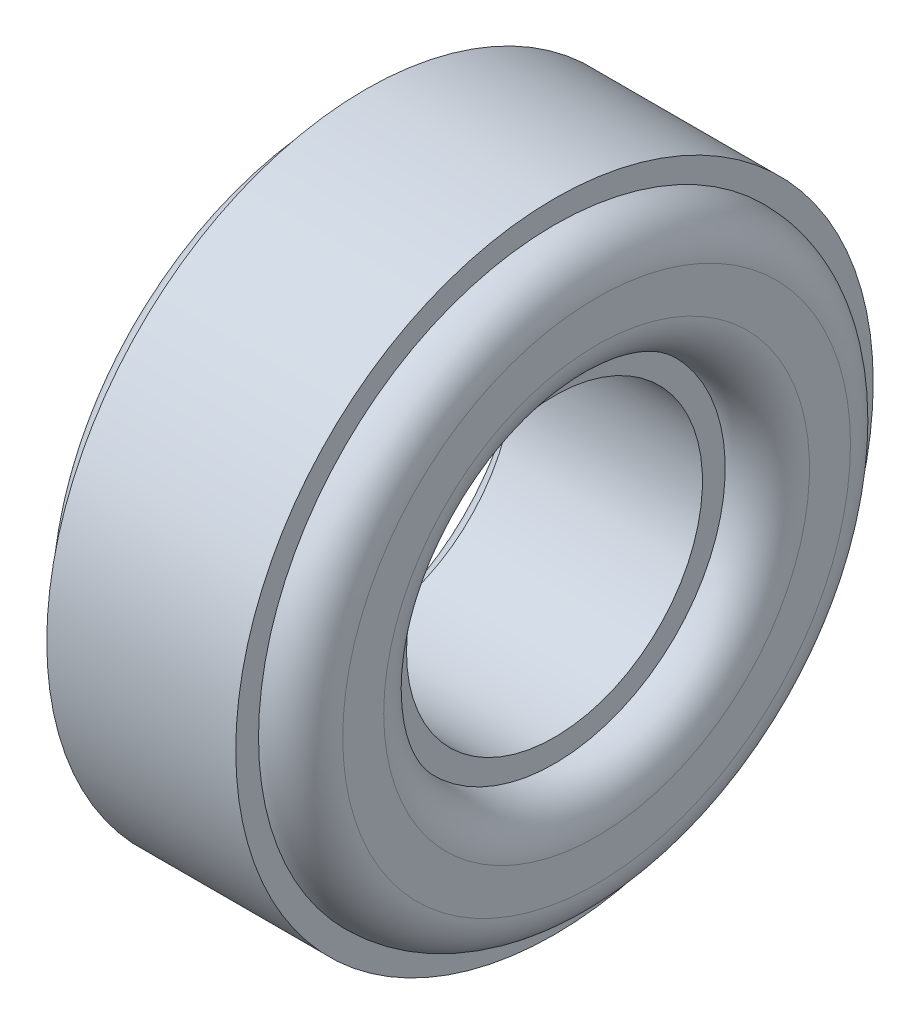
ISO-10303-21;
HEADER;
FILE_DESCRIPTION(('STEP AP214'),'2;1');
FILE_NAME('part.step','',(''),(''),'','','');
FILE_SCHEMA(('AUTOMOTIVE_DESIGN { 1 0 10303 214 1 1 1 1 }'));
ENDSEC;
DATA;
#1=APPLICATION_CONTEXT('core data for automotive mechanical design processes');
#2=APPLICATION_PROTOCOL_DEFINITION('international standard','automotive_design',2000,#1);
#3=PRODUCT_CONTEXT('',#1,'mechanical');
#4=PRODUCT('Part','Part','',(#3));
#5=PRODUCT_RELATED_PRODUCT_CATEGORY('part','',(#4));
#6=PRODUCT_DEFINITION_FORMATION('','',#4);
#7=PRODUCT_DEFINITION_CONTEXT('part definition',#1,'design');
#8=PRODUCT_DEFINITION('design','',#6,#7);
#9=PRODUCT_DEFINITION_SHAPE('','',#8);
#10=(LENGTH_UNIT() NAMED_UNIT(*) SI_UNIT(.MILLI.,.METRE.));
#11=(NAMED_UNIT(*) PLANE_ANGLE_UNIT() SI_UNIT($,.RADIAN.));
#12=(NAMED_UNIT(*) SI_UNIT($,.STERADIAN.) SOLID_ANGLE_UNIT());
#13=UNCERTAINTY_MEASURE_WITH_UNIT(LENGTH_MEASURE(1.E-05),#10,'distance_accuracy_value','');
#14=(GEOMETRIC_REPRESENTATION_CONTEXT(3) GLOBAL_UNCERTAINTY_ASSIGNED_CONTEXT((#13)) GLOBAL_UNIT_ASSIGNED_CONTEXT((#10,
#11,#12)) REPRESENTATION_CONTEXT('',''));
#15=CARTESIAN_POINT('',(0.,0.,0.));
#16=DIRECTION('',(0.,0.,1.));
#17=DIRECTION('',(1.,0.,0.));
#18=AXIS2_PLACEMENT_3D('',#15,#16,#17);
#19=CARTESIAN_POINT('',(0.,14.,0.));
#20=DIRECTION('',(1.,0.,0.));
#21=DIRECTION('',(0.,0.,-1.));
#22=AXIS2_PLACEMENT_3D('',#19,#20,#21);
#23=PLANE('',#22);
#24=CARTESIAN_POINT('',(0.,0.,0.));
#25=DIRECTION('',(-1.,0.,0.));
#26=DIRECTION('',(0.,0.,1.));
#27=AXIS2_PLACEMENT_3D('',#24,#25,#26);
#28=CIRCLE('',#27,13.);
#29=CARTESIAN_POINT('',(0.,0.,13.));
#30=VERTEX_POINT('',#29);
#31=EDGE_CURVE('E10',#30,#30,#28,.T.);
#32=ORIENTED_EDGE('',*,*,#31,.F.);
#33=EDGE_LOOP('',(#32));
#34=FACE_BOUND('',#33,.T.);
#35=CARTESIAN_POINT('',(0.,0.,0.));
#36=DIRECTION('',(-1.,0.,0.));
#37=DIRECTION('',(0.,0.,1.));
#38=AXIS2_PLACEMENT_3D('',#35,#36,#37);
#39=CIRCLE('',#38,14.);
#40=CARTESIAN_POINT('',(0.,0.,14.));
#41=VERTEX_POINT('',#40);
#42=EDGE_CURVE('E81',#41,#41,#39,.T.);
#43=ORIENTED_EDGE('',*,*,#42,.T.);
#44=EDGE_LOOP('',(#43));
#45=FACE_BOUND('',#44,.T.);
#46=ADVANCED_FACE('F41',(#34,#45),#23,.F.);
#47=CARTESIAN_POINT('',(0.,0.,0.));
#48=DIRECTION('',(-1.,0.,0.));
#49=DIRECTION('',(0.,0.,1.));
#50=AXIS2_PLACEMENT_3D('',#47,#48,#49);
#51=TOROIDAL_SURFACE('',#50,11.15,1.85);
#52=CARTESIAN_POINT('',(-1.85,0.,0.));
#53=DIRECTION('',(-1.,0.,0.));
#54=DIRECTION('',(0.,0.,1.));
#55=AXIS2_PLACEMENT_3D('',#52,#53,#54);
#56=CIRCLE('',#55,11.15);
#57=CARTESIAN_POINT('',(-1.85,0.,11.15));
#58=VERTEX_POINT('',#57);
#59=EDGE_CURVE('E47',#58,#58,#56,.T.);
#60=ORIENTED_EDGE('',*,*,#59,.F.);
#61=EDGE_LOOP('',(#60));
#62=FACE_BOUND('',#61,.T.);
#63=ORIENTED_EDGE('',*,*,#31,.T.);
#64=EDGE_LOOP('',(#63));
#65=FACE_BOUND('',#64,.T.);
#66=ADVANCED_FACE('F142',(#62,#65),#51,.T.);
#67=CARTESIAN_POINT('',(-1.85,9.35,0.));
#68=DIRECTION('',(1.,0.,0.));
#69=DIRECTION('',(0.,0.,-1.));
#70=AXIS2_PLACEMENT_3D('',#67,#68,#69);
#71=PLANE('',#70);
#72=CARTESIAN_POINT('',(-1.85,0.,0.));
#73=DIRECTION('',(-1.,0.,0.));
#74=DIRECTION('',(0.,0.,1.));
#75=AXIS2_PLACEMENT_3D('',#72,#73,#74);
#76=CIRCLE('',#75,9.35);
#77=CARTESIAN_POINT('',(-1.85,0.,9.35));
#78=VERTEX_POINT('',#77);
#79=EDGE_CURVE('E51',#78,#78,#76,.T.);
#80=ORIENTED_EDGE('',*,*,#79,.F.);
#81=EDGE_LOOP('',(#80));
#82=FACE_BOUND('',#81,.T.);
#83=ORIENTED_EDGE('',*,*,#59,.T.);
#84=EDGE_LOOP('',(#83));
#85=FACE_BOUND('',#84,.T.);
#86=ADVANCED_FACE('F137',(#82,#85),#71,.F.);
#87=CARTESIAN_POINT('',(0.,0.,0.));
#88=DIRECTION('',(-1.,0.,0.));
#89=DIRECTION('',(0.,0.,1.));
#90=AXIS2_PLACEMENT_3D('',#87,#88,#89);
#91=TOROIDAL_SURFACE('',#90,9.35,1.85);
#92=CARTESIAN_POINT('',(0.,0.,0.));
#93=DIRECTION('',(-1.,0.,0.));
#94=DIRECTION('',(0.,0.,1.));
#95=AXIS2_PLACEMENT_3D('',#92,#93,#94);
#96=CIRCLE('',#95,7.5);
#97=CARTESIAN_POINT('',(0.,0.,7.5));
#98=VERTEX_POINT('',#97);
#99=EDGE_CURVE('E55',#98,#98,#96,.T.);
#100=ORIENTED_EDGE('',*,*,#99,.F.);
#101=EDGE_LOOP('',(#100));
#102=FACE_BOUND('',#101,.T.);
#103=ORIENTED_EDGE('',*,*,#79,.T.);
#104=EDGE_LOOP('',(#103));
#105=FACE_BOUND('',#104,.T.);
#106=ADVANCED_FACE('F131',(#102,#105),#91,.T.);
#107=CARTESIAN_POINT('',(0.,7.5,0.));
#108=DIRECTION('',(1.,0.,0.));
#109=DIRECTION('',(0.,0.,-1.));
#110=AXIS2_PLACEMENT_3D('',#107,#108,#109);
#111=PLANE('',#110);
#112=CARTESIAN_POINT('',(0.,0.,0.));
#113=DIRECTION('',(-1.,0.,0.));
#114=DIRECTION('',(0.,0.,1.));
#115=AXIS2_PLACEMENT_3D('',#112,#113,#114);
#116=CIRCLE('',#115,6.5);
#117=CARTESIAN_POINT('',(0.,0.,6.5));
#118=VERTEX_POINT('',#117);
#119=EDGE_CURVE('E60',#118,#118,#116,.T.);
#120=ORIENTED_EDGE('',*,*,#119,.F.);
#121=EDGE_LOOP('',(#120));
#122=FACE_BOUND('',#121,.T.);
#123=ORIENTED_EDGE('',*,*,#99,.T.);
#124=EDGE_LOOP('',(#123));
#125=FACE_BOUND('',#124,.T.);
#126=ADVANCED_FACE('F125',(#122,#125),#111,.F.);
#127=CARTESIAN_POINT('',(-8.83301647318569,0.,0.));
#128=DIRECTION('',(-1.,0.,0.));
#129=DIRECTION('',(0.,0.,1.));
#130=AXIS2_PLACEMENT_3D('',#127,#128,#129);
#131=CYLINDRICAL_SURFACE('',#130,6.5);
#132=CARTESIAN_POINT('',(8.3,0.,0.));
#133=DIRECTION('',(-1.,0.,0.));
#134=DIRECTION('',(0.,0.,1.));
#135=AXIS2_PLACEMENT_3D('',#132,#133,#134);
#136=CIRCLE('',#135,6.5);
#137=CARTESIAN_POINT('',(8.3,0.,6.5));
#138=VERTEX_POINT('',#137);
#139=EDGE_CURVE('E63',#138,#138,#136,.T.);
#140=ORIENTED_EDGE('',*,*,#139,.F.);
#141=EDGE_LOOP('',(#140));
#142=FACE_BOUND('',#141,.T.);
#143=ORIENTED_EDGE('',*,*,#119,.T.);
#144=EDGE_LOOP('',(#143));
#145=FACE_BOUND('',#144,.T.);
#146=ADVANCED_FACE('F119',(#142,#145),#131,.F.);
#147=CARTESIAN_POINT('',(8.3,7.5,0.));
#148=DIRECTION('',(-1.,0.,0.));
#149=DIRECTION('',(0.,0.,1.));
#150=AXIS2_PLACEMENT_3D('',#147,#148,#149);
#151=PLANE('',#150);
#152=CARTESIAN_POINT('',(8.30000000000001,0.,0.));
#153=DIRECTION('',(-1.,0.,0.));
#154=DIRECTION('',(0.,0.,1.));
#155=AXIS2_PLACEMENT_3D('',#152,#153,#154);
#156=CIRCLE('',#155,7.5);
#157=CARTESIAN_POINT('',(8.30000000000001,0.,7.5));
#158=VERTEX_POINT('',#157);
#159=EDGE_CURVE('E66',#158,#158,#156,.T.);
#160=ORIENTED_EDGE('',*,*,#159,.F.);
#161=EDGE_LOOP('',(#160));
#162=FACE_BOUND('',#161,.T.);
#163=ORIENTED_EDGE('',*,*,#139,.T.);
#164=EDGE_LOOP('',(#163));
#165=FACE_BOUND('',#164,.T.);
#166=ADVANCED_FACE('F113',(#162,#165),#151,.F.);
#167=CARTESIAN_POINT('',(8.3,0.,0.));
#168=DIRECTION('',(-1.,0.,0.));
#169=DIRECTION('',(0.,0.,1.));
#170=AXIS2_PLACEMENT_3D('',#167,#168,#169);
#171=TOROIDAL_SURFACE('',#170,9.35,1.85);
#172=CARTESIAN_POINT('',(10.15,0.,0.));
#173=DIRECTION('',(-1.,0.,0.));
#174=DIRECTION('',(0.,0.,1.));
#175=AXIS2_PLACEMENT_3D('',#172,#173,#174);
#176=CIRCLE('',#175,9.35);
#177=CARTESIAN_POINT('',(10.15,0.,9.35));
#178=VERTEX_POINT('',#177);
#179=EDGE_CURVE('E69',#178,#178,#176,.T.);
#180=ORIENTED_EDGE('',*,*,#179,.F.);
#181=EDGE_LOOP('',(#180));
#182=FACE_BOUND('',#181,.T.);
#183=ORIENTED_EDGE('',*,*,#159,.T.);
#184=EDGE_LOOP('',(#183));
#185=FACE_BOUND('',#184,.T.);
#186=ADVANCED_FACE('F107',(#182,#185),#171,.T.);
#187=CARTESIAN_POINT('',(10.15,9.35,0.));
#188=DIRECTION('',(-1.,0.,0.));
#189=DIRECTION('',(0.,0.,1.));
#190=AXIS2_PLACEMENT_3D('',#187,#188,#189);
#191=PLANE('',#190);
#192=CARTESIAN_POINT('',(10.15,0.,0.));
#193=DIRECTION('',(-1.,0.,0.));
#194=DIRECTION('',(0.,0.,1.));
#195=AXIS2_PLACEMENT_3D('',#192,#193,#194);
#196=CIRCLE('',#195,11.15);
#197=CARTESIAN_POINT('',(10.15,0.,11.15));
#198=VERTEX_POINT('',#197);
#199=EDGE_CURVE('E72',#198,#198,#196,.T.);
#200=ORIENTED_EDGE('',*,*,#199,.F.);
#201=EDGE_LOOP('',(#200));
#202=FACE_BOUND('',#201,.T.);
#203=ORIENTED_EDGE('',*,*,#179,.T.);
#204=EDGE_LOOP('',(#203));
#205=FACE_BOUND('',#204,.T.);
#206=ADVANCED_FACE('F101',(#202,#205),#191,.F.);
#207=CARTESIAN_POINT('',(8.3,0.,0.));
#208=DIRECTION('',(-1.,0.,0.));
#209=DIRECTION('',(0.,0.,1.));
#210=AXIS2_PLACEMENT_3D('',#207,#208,#209);
#211=TOROIDAL_SURFACE('',#210,11.15,1.85);
#212=CARTESIAN_POINT('',(8.3,0.,0.));
#213=DIRECTION('',(-1.,0.,0.));
#214=DIRECTION('',(0.,0.,1.));
#215=AXIS2_PLACEMENT_3D('',#212,#213,#214);
#216=CIRCLE('',#215,13.);
#217=CARTESIAN_POINT('',(8.3,0.,13.));
#218=VERTEX_POINT('',#217);
#219=EDGE_CURVE('E75',#218,#218,#216,.T.);
#220=ORIENTED_EDGE('',*,*,#219,.F.);
#221=EDGE_LOOP('',(#220));
#222=FACE_BOUND('',#221,.T.);
#223=ORIENTED_EDGE('',*,*,#199,.T.);
#224=EDGE_LOOP('',(#223));
#225=FACE_BOUND('',#224,.T.);
#226=ADVANCED_FACE('F95',(#222,#225),#211,.T.);
#227=CARTESIAN_POINT('',(8.3,14.,0.));
#228=DIRECTION('',(-1.,0.,0.));
#229=DIRECTION('',(0.,0.,1.));
#230=AXIS2_PLACEMENT_3D('',#227,#228,#229);
#231=PLANE('',#230);
#232=CARTESIAN_POINT('',(8.3,0.,0.));
#233=DIRECTION('',(-1.,0.,0.));
#234=DIRECTION('',(0.,0.,1.));
#235=AXIS2_PLACEMENT_3D('',#232,#233,#234);
#236=CIRCLE('',#235,14.);
#237=CARTESIAN_POINT('',(8.3,0.,14.));
#238=VERTEX_POINT('',#237);
#239=EDGE_CURVE('E78',#238,#238,#236,.T.);
#240=ORIENTED_EDGE('',*,*,#239,.F.);
#241=EDGE_LOOP('',(#240));
#242=FACE_BOUND('',#241,.T.);
#243=ORIENTED_EDGE('',*,*,#219,.T.);
#244=EDGE_LOOP('',(#243));
#245=FACE_BOUND('',#244,.T.);
#246=ADVANCED_FACE('F89',(#242,#245),#231,.F.);
#247=CARTESIAN_POINT('',(-8.83301647318569,0.,0.));
#248=DIRECTION('',(-1.,0.,0.));
#249=DIRECTION('',(0.,0.,1.));
#250=AXIS2_PLACEMENT_3D('',#247,#248,#249);
#251=CYLINDRICAL_SURFACE('',#250,14.);
#252=ORIENTED_EDGE('',*,*,#42,.F.);
#253=EDGE_LOOP('',(#252));
#254=FACE_BOUND('',#253,.T.);
#255=ORIENTED_EDGE('',*,*,#239,.T.);
#256=EDGE_LOOP('',(#255));
#257=FACE_BOUND('',#256,.T.);
#258=ADVANCED_FACE('F86',(#254,#257),#251,.T.);
#259=CLOSED_SHELL('',(#46,#66,#86,#106,#126,#146,#166,#186,#206,#226,#246,#258));
#260=MANIFOLD_SOLID_BREP('B2',#259);
#261=ADVANCED_BREP_SHAPE_REPRESENTATION('',(#18,#260),#14);
#262=SHAPE_DEFINITION_REPRESENTATION(#9,#261);
ENDSEC;
END-ISO-10303-21;
